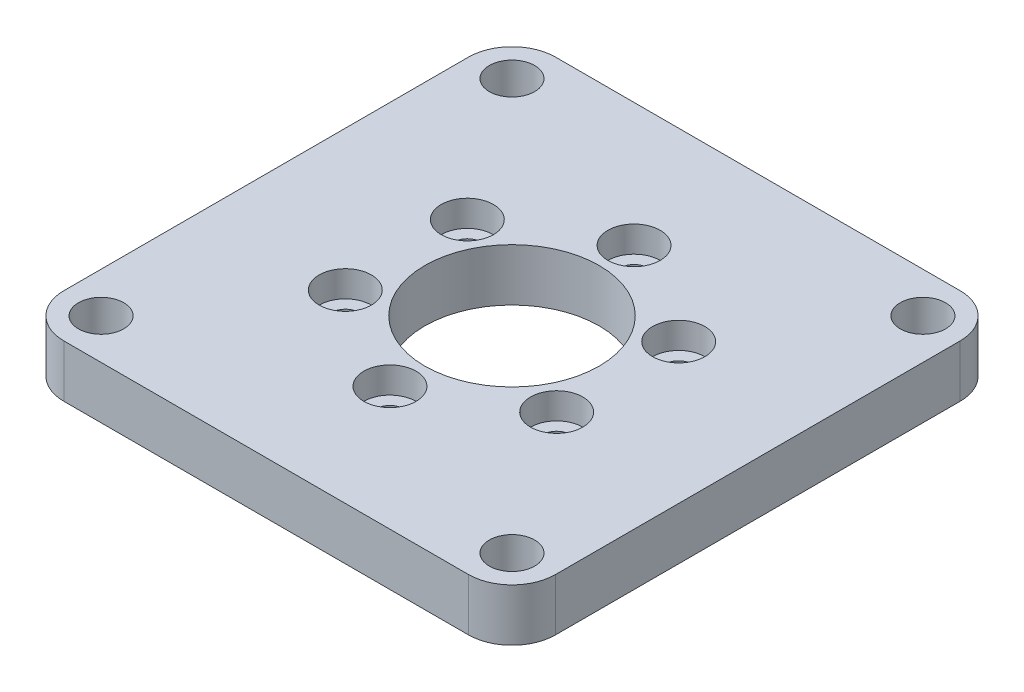
ISO-10303-21;
HEADER;
FILE_DESCRIPTION(('STEP AP214'),'2;1');
FILE_NAME('part.step','',(''),(''),'','','');
FILE_SCHEMA(('AUTOMOTIVE_DESIGN { 1 0 10303 214 1 1 1 1 }'));
ENDSEC;
DATA;
#1=APPLICATION_CONTEXT('core data for automotive mechanical design processes');
#2=APPLICATION_PROTOCOL_DEFINITION('international standard','automotive_design',2000,#1);
#3=PRODUCT_CONTEXT('',#1,'mechanical');
#4=PRODUCT('Part','Part','',(#3));
#5=PRODUCT_RELATED_PRODUCT_CATEGORY('part','',(#4));
#6=PRODUCT_DEFINITION_FORMATION('','',#4);
#7=PRODUCT_DEFINITION_CONTEXT('part definition',#1,'design');
#8=PRODUCT_DEFINITION('design','',#6,#7);
#9=PRODUCT_DEFINITION_SHAPE('','',#8);
#10=(LENGTH_UNIT() NAMED_UNIT(*) SI_UNIT(.MILLI.,.METRE.));
#11=(NAMED_UNIT(*) PLANE_ANGLE_UNIT() SI_UNIT($,.RADIAN.));
#12=(NAMED_UNIT(*) SI_UNIT($,.STERADIAN.) SOLID_ANGLE_UNIT());
#13=UNCERTAINTY_MEASURE_WITH_UNIT(LENGTH_MEASURE(1.E-05),#10,'distance_accuracy_value','');
#14=(GEOMETRIC_REPRESENTATION_CONTEXT(3) GLOBAL_UNCERTAINTY_ASSIGNED_CONTEXT((#13)) GLOBAL_UNIT_ASSIGNED_CONTEXT((#10,
#11,#12)) REPRESENTATION_CONTEXT('',''));
#15=CARTESIAN_POINT('',(0.,0.,0.));
#16=DIRECTION('',(0.,0.,1.));
#17=DIRECTION('',(1.,0.,0.));
#18=AXIS2_PLACEMENT_3D('',#15,#16,#17);
#19=CARTESIAN_POINT('',(-12.1243556529821,-3.,-7.00000000000014));
#20=DIRECTION('',(0.,1.,0.));
#21=DIRECTION('',(0.,0.,1.));
#22=AXIS2_PLACEMENT_3D('',#19,#20,#21);
#23=CYLINDRICAL_SURFACE('',#22,1.55);
#24=CARTESIAN_POINT('',(-12.1243556529821,-3.,-7.00000000000014));
#25=DIRECTION('',(0.,1.,0.));
#26=DIRECTION('',(0.866025403784433,0.,0.50000000000001));
#27=AXIS2_PLACEMENT_3D('',#24,#25,#26);
#28=CIRCLE('',#27,1.55);
#29=CARTESIAN_POINT('',(-10.7820162771162,-3.,-6.22500000000013));
#30=VERTEX_POINT('',#29);
#31=EDGE_CURVE('E169',#30,#30,#28,.T.);
#32=ORIENTED_EDGE('',*,*,#31,.F.);
#33=EDGE_LOOP('',(#32));
#34=FACE_BOUND('',#33,.T.);
#35=CARTESIAN_POINT('',(-12.1243556529821,0.,-7.00000000000014));
#36=DIRECTION('',(0.,1.,0.));
#37=DIRECTION('',(0.,0.,1.));
#38=AXIS2_PLACEMENT_3D('',#35,#36,#37);
#39=CIRCLE('',#38,1.55);
#40=CARTESIAN_POINT('',(-12.1243556529821,0.,-5.45000000000014));
#41=VERTEX_POINT('',#40);
#42=EDGE_CURVE('E41',#41,#41,#39,.F.);
#43=ORIENTED_EDGE('',*,*,#42,.F.);
#44=EDGE_LOOP('',(#43));
#45=FACE_BOUND('',#44,.T.);
#46=ADVANCED_FACE('F37',(#34,#45),#23,.F.);
#47=CARTESIAN_POINT('',(-12.1243556529822,-3.,6.99999999999989));
#48=DIRECTION('',(0.,1.,0.));
#49=DIRECTION('',(0.,0.,1.));
#50=AXIS2_PLACEMENT_3D('',#47,#48,#49);
#51=CYLINDRICAL_SURFACE('',#50,1.55);
#52=CARTESIAN_POINT('',(-12.1243556529822,-3.,6.99999999999989));
#53=DIRECTION('',(0.,1.,0.));
#54=DIRECTION('',(0.866025403784443,0.,-0.499999999999992));
#55=AXIS2_PLACEMENT_3D('',#52,#53,#54);
#56=CIRCLE('',#55,1.55);
#57=CARTESIAN_POINT('',(-10.7820162771163,-3.,6.2249999999999));
#58=VERTEX_POINT('',#57);
#59=EDGE_CURVE('E211',#58,#58,#56,.T.);
#60=ORIENTED_EDGE('',*,*,#59,.F.);
#61=EDGE_LOOP('',(#60));
#62=FACE_BOUND('',#61,.T.);
#63=CARTESIAN_POINT('',(-12.1243556529822,0.,6.99999999999989));
#64=DIRECTION('',(0.,1.,0.));
#65=DIRECTION('',(0.,0.,1.));
#66=AXIS2_PLACEMENT_3D('',#63,#64,#65);
#67=CIRCLE('',#66,1.55);
#68=CARTESIAN_POINT('',(-12.1243556529822,0.,8.54999999999989));
#69=VERTEX_POINT('',#68);
#70=EDGE_CURVE('E180',#69,#69,#67,.F.);
#71=ORIENTED_EDGE('',*,*,#70,.F.);
#72=EDGE_LOOP('',(#71));
#73=FACE_BOUND('',#72,.T.);
#74=ADVANCED_FACE('F288',(#62,#73),#51,.F.);
#75=CARTESIAN_POINT('',(0.,-3.,14.));
#76=DIRECTION('',(0.,1.,0.));
#77=DIRECTION('',(0.,0.,1.));
#78=AXIS2_PLACEMENT_3D('',#75,#76,#77);
#79=CYLINDRICAL_SURFACE('',#78,1.55);
#80=CARTESIAN_POINT('',(0.,-3.,14.));
#81=DIRECTION('',(0.,1.,0.));
#82=DIRECTION('',(0.,0.,-1.));
#83=AXIS2_PLACEMENT_3D('',#80,#81,#82);
#84=CIRCLE('',#83,1.55);
#85=CARTESIAN_POINT('',(0.,-3.,12.45));
#86=VERTEX_POINT('',#85);
#87=EDGE_CURVE('E214',#86,#86,#84,.T.);
#88=ORIENTED_EDGE('',*,*,#87,.F.);
#89=EDGE_LOOP('',(#88));
#90=FACE_BOUND('',#89,.T.);
#91=CARTESIAN_POINT('',(0.,0.,14.));
#92=DIRECTION('',(0.,1.,0.));
#93=DIRECTION('',(0.,0.,1.));
#94=AXIS2_PLACEMENT_3D('',#91,#92,#93);
#95=CIRCLE('',#94,1.55);
#96=CARTESIAN_POINT('',(0.,0.,15.55));
#97=VERTEX_POINT('',#96);
#98=EDGE_CURVE('E176',#97,#97,#95,.F.);
#99=ORIENTED_EDGE('',*,*,#98,.F.);
#100=EDGE_LOOP('',(#99));
#101=FACE_BOUND('',#100,.T.);
#102=ADVANCED_FACE('F294',(#90,#101),#79,.F.);
#103=CARTESIAN_POINT('',(12.1243556529821,-3.,7.00000000000006));
#104=DIRECTION('',(0.,1.,0.));
#105=DIRECTION('',(0.,0.,1.));
#106=AXIS2_PLACEMENT_3D('',#103,#104,#105);
#107=CYLINDRICAL_SURFACE('',#106,1.55);
#108=CARTESIAN_POINT('',(12.1243556529821,-3.,7.00000000000006));
#109=DIRECTION('',(0.,1.,0.));
#110=DIRECTION('',(-0.866025403784436,0.,-0.500000000000004));
#111=AXIS2_PLACEMENT_3D('',#108,#109,#110);
#112=CIRCLE('',#111,1.55);
#113=CARTESIAN_POINT('',(10.7820162771162,-3.,6.22500000000005));
#114=VERTEX_POINT('',#113);
#115=EDGE_CURVE('E217',#114,#114,#112,.T.);
#116=ORIENTED_EDGE('',*,*,#115,.F.);
#117=EDGE_LOOP('',(#116));
#118=FACE_BOUND('',#117,.T.);
#119=CARTESIAN_POINT('',(12.1243556529821,0.,7.00000000000006));
#120=DIRECTION('',(0.,1.,0.));
#121=DIRECTION('',(0.,0.,1.));
#122=AXIS2_PLACEMENT_3D('',#119,#120,#121);
#123=CIRCLE('',#122,1.55);
#124=CARTESIAN_POINT('',(12.1243556529821,0.,8.55000000000006));
#125=VERTEX_POINT('',#124);
#126=EDGE_CURVE('E171',#125,#125,#123,.F.);
#127=ORIENTED_EDGE('',*,*,#126,.F.);
#128=EDGE_LOOP('',(#127));
#129=FACE_BOUND('',#128,.T.);
#130=ADVANCED_FACE('F305',(#118,#129),#107,.F.);
#131=CARTESIAN_POINT('',(12.1243556529822,-3.,-6.99999999999997));
#132=DIRECTION('',(0.,1.,0.));
#133=DIRECTION('',(0.,0.,1.));
#134=AXIS2_PLACEMENT_3D('',#131,#132,#133);
#135=CYLINDRICAL_SURFACE('',#134,1.55);
#136=CARTESIAN_POINT('',(12.1243556529822,-3.,-6.99999999999997));
#137=DIRECTION('',(0.,1.,0.));
#138=DIRECTION('',(-0.86602540378444,0.,0.499999999999998));
#139=AXIS2_PLACEMENT_3D('',#136,#137,#138);
#140=CIRCLE('',#139,1.55);
#141=CARTESIAN_POINT('',(10.7820162771163,-3.,-6.22499999999998));
#142=VERTEX_POINT('',#141);
#143=EDGE_CURVE('E220',#142,#142,#140,.T.);
#144=ORIENTED_EDGE('',*,*,#143,.F.);
#145=EDGE_LOOP('',(#144));
#146=FACE_BOUND('',#145,.T.);
#147=CARTESIAN_POINT('',(12.1243556529822,0.,-6.99999999999997));
#148=DIRECTION('',(0.,1.,0.));
#149=DIRECTION('',(0.,0.,1.));
#150=AXIS2_PLACEMENT_3D('',#147,#148,#149);
#151=CIRCLE('',#150,1.55);
#152=CARTESIAN_POINT('',(12.1243556529822,0.,-5.44999999999997));
#153=VERTEX_POINT('',#152);
#154=EDGE_CURVE('E166',#153,#153,#151,.F.);
#155=ORIENTED_EDGE('',*,*,#154,.F.);
#156=EDGE_LOOP('',(#155));
#157=FACE_BOUND('',#156,.T.);
#158=ADVANCED_FACE('F309',(#146,#157),#135,.F.);
#159=CARTESIAN_POINT('',(0.,-3.,-14.));
#160=DIRECTION('',(0.,1.,0.));
#161=DIRECTION('',(0.,0.,1.));
#162=AXIS2_PLACEMENT_3D('',#159,#160,#161);
#163=CYLINDRICAL_SURFACE('',#162,1.55);
#164=CARTESIAN_POINT('',(0.,-3.,-14.));
#165=DIRECTION('',(0.,1.,0.));
#166=DIRECTION('',(0.,0.,1.));
#167=AXIS2_PLACEMENT_3D('',#164,#165,#166);
#168=CIRCLE('',#167,1.55);
#169=CARTESIAN_POINT('',(0.,-3.,-12.45));
#170=VERTEX_POINT('',#169);
#171=EDGE_CURVE('E164',#170,#170,#168,.T.);
#172=ORIENTED_EDGE('',*,*,#171,.F.);
#173=EDGE_LOOP('',(#172));
#174=FACE_BOUND('',#173,.T.);
#175=CARTESIAN_POINT('',(0.,0.,-14.));
#176=DIRECTION('',(0.,1.,0.));
#177=DIRECTION('',(0.,0.,1.));
#178=AXIS2_PLACEMENT_3D('',#175,#176,#177);
#179=CIRCLE('',#178,1.55);
#180=CARTESIAN_POINT('',(0.,0.,-12.45));
#181=VERTEX_POINT('',#180);
#182=EDGE_CURVE('E161',#181,#181,#179,.F.);
#183=ORIENTED_EDGE('',*,*,#182,.F.);
#184=EDGE_LOOP('',(#183));
#185=FACE_BOUND('',#184,.T.);
#186=ADVANCED_FACE('F313',(#174,#185),#163,.F.);
#187=CARTESIAN_POINT('',(28.2,3.,-28.2));
#188=DIRECTION('',(-1.,0.,0.));
#189=DIRECTION('',(0.,0.,1.));
#190=AXIS2_PLACEMENT_3D('',#187,#188,#189);
#191=PLANE('',#190);
#192=DIRECTION('',(0.,0.,-1.));
#193=VECTOR('',#192,1.);
#194=CARTESIAN_POINT('',(28.2,-3.,-28.2));
#195=LINE('',#194,#193);
#196=CARTESIAN_POINT('',(28.2,-3.,23.2));
#197=VERTEX_POINT('',#196);
#198=CARTESIAN_POINT('',(28.2,-3.,-23.2));
#199=VERTEX_POINT('',#198);
#200=EDGE_CURVE('E258',#197,#199,#195,.T.);
#201=ORIENTED_EDGE('',*,*,#200,.T.);
#202=DIRECTION('',(0.,-1.,0.));
#203=VECTOR('',#202,1.);
#204=CARTESIAN_POINT('',(28.2,3.,-23.2));
#205=LINE('',#204,#203);
#206=CARTESIAN_POINT('',(28.2,3.,-23.2));
#207=VERTEX_POINT('',#206);
#208=EDGE_CURVE('E11',#199,#207,#205,.F.);
#209=ORIENTED_EDGE('',*,*,#208,.T.);
#210=DIRECTION('',(0.,0.,-1.));
#211=VECTOR('',#210,1.);
#212=CARTESIAN_POINT('',(28.2,3.,-28.2));
#213=LINE('',#212,#211);
#214=CARTESIAN_POINT('',(28.2,3.,23.2));
#215=VERTEX_POINT('',#214);
#216=EDGE_CURVE('E131',#215,#207,#213,.T.);
#217=ORIENTED_EDGE('',*,*,#216,.F.);
#218=DIRECTION('',(0.,-1.,0.));
#219=VECTOR('',#218,1.);
#220=CARTESIAN_POINT('',(28.2,3.,23.2));
#221=LINE('',#220,#219);
#222=EDGE_CURVE('E46',#215,#197,#221,.T.);
#223=ORIENTED_EDGE('',*,*,#222,.T.);
#224=EDGE_LOOP('',(#201,#209,#217,#223));
#225=FACE_BOUND('',#224,.T.);
#226=ADVANCED_FACE('F285',(#225),#191,.F.);
#227=CARTESIAN_POINT('',(-28.2,3.,-28.2));
#228=DIRECTION('',(0.,0.,1.));
#229=DIRECTION('',(1.,0.,0.));
#230=AXIS2_PLACEMENT_3D('',#227,#228,#229);
#231=PLANE('',#230);
#232=DIRECTION('',(-1.,0.,0.));
#233=VECTOR('',#232,1.);
#234=CARTESIAN_POINT('',(-28.2,-3.,-28.2));
#235=LINE('',#234,#233);
#236=CARTESIAN_POINT('',(23.2,-3.,-28.2));
#237=VERTEX_POINT('',#236);
#238=CARTESIAN_POINT('',(-23.2,-3.,-28.2));
#239=VERTEX_POINT('',#238);
#240=EDGE_CURVE('E136',#237,#239,#235,.T.);
#241=ORIENTED_EDGE('',*,*,#240,.T.);
#242=DIRECTION('',(0.,-1.,0.));
#243=VECTOR('',#242,1.);
#244=CARTESIAN_POINT('',(-23.2,3.,-28.2));
#245=LINE('',#244,#243);
#246=CARTESIAN_POINT('',(-23.2,3.,-28.2));
#247=VERTEX_POINT('',#246);
#248=EDGE_CURVE('E54',#239,#247,#245,.F.);
#249=ORIENTED_EDGE('',*,*,#248,.T.);
#250=DIRECTION('',(-1.,0.,0.));
#251=VECTOR('',#250,1.);
#252=CARTESIAN_POINT('',(-28.2,3.,-28.2));
#253=LINE('',#252,#251);
#254=CARTESIAN_POINT('',(23.2,3.,-28.2));
#255=VERTEX_POINT('',#254);
#256=EDGE_CURVE('E134',#255,#247,#253,.T.);
#257=ORIENTED_EDGE('',*,*,#256,.F.);
#258=DIRECTION('',(0.,-1.,0.));
#259=VECTOR('',#258,1.);
#260=CARTESIAN_POINT('',(23.2,3.,-28.2));
#261=LINE('',#260,#259);
#262=EDGE_CURVE('E155',#255,#237,#261,.T.);
#263=ORIENTED_EDGE('',*,*,#262,.T.);
#264=EDGE_LOOP('',(#241,#249,#257,#263));
#265=FACE_BOUND('',#264,.T.);
#266=ADVANCED_FACE('F268',(#265),#231,.F.);
#267=CARTESIAN_POINT('',(-28.2,3.,-28.2));
#268=DIRECTION('',(1.,0.,0.));
#269=DIRECTION('',(0.,0.,-1.));
#270=AXIS2_PLACEMENT_3D('',#267,#268,#269);
#271=PLANE('',#270);
#272=DIRECTION('',(0.,0.,1.));
#273=VECTOR('',#272,1.);
#274=CARTESIAN_POINT('',(-28.2,-3.,-28.2));
#275=LINE('',#274,#273);
#276=CARTESIAN_POINT('',(-28.2,-3.,-23.2));
#277=VERTEX_POINT('',#276);
#278=CARTESIAN_POINT('',(-28.2,-3.,23.2));
#279=VERTEX_POINT('',#278);
#280=EDGE_CURVE('E132',#277,#279,#275,.T.);
#281=ORIENTED_EDGE('',*,*,#280,.T.);
#282=DIRECTION('',(0.,-1.,0.));
#283=VECTOR('',#282,1.);
#284=CARTESIAN_POINT('',(-28.2,3.,23.2));
#285=LINE('',#284,#283);
#286=CARTESIAN_POINT('',(-28.2,3.,23.2));
#287=VERTEX_POINT('',#286);
#288=EDGE_CURVE('E110',#279,#287,#285,.F.);
#289=ORIENTED_EDGE('',*,*,#288,.T.);
#290=DIRECTION('',(0.,0.,1.));
#291=VECTOR('',#290,1.);
#292=CARTESIAN_POINT('',(-28.2,3.,-28.2));
#293=LINE('',#292,#291);
#294=CARTESIAN_POINT('',(-28.2,3.,-23.2));
#295=VERTEX_POINT('',#294);
#296=EDGE_CURVE('E262',#295,#287,#293,.T.);
#297=ORIENTED_EDGE('',*,*,#296,.F.);
#298=DIRECTION('',(0.,-1.,0.));
#299=VECTOR('',#298,1.);
#300=CARTESIAN_POINT('',(-28.2,3.,-23.2));
#301=LINE('',#300,#299);
#302=EDGE_CURVE('E115',#295,#277,#301,.T.);
#303=ORIENTED_EDGE('',*,*,#302,.T.);
#304=EDGE_LOOP('',(#281,#289,#297,#303));
#305=FACE_BOUND('',#304,.T.);
#306=ADVANCED_FACE('F277',(#305),#271,.F.);
#307=CARTESIAN_POINT('',(-28.2,3.,28.2));
#308=DIRECTION('',(0.,0.,-1.));
#309=DIRECTION('',(-1.,0.,0.));
#310=AXIS2_PLACEMENT_3D('',#307,#308,#309);
#311=PLANE('',#310);
#312=DIRECTION('',(1.,0.,0.));
#313=VECTOR('',#312,1.);
#314=CARTESIAN_POINT('',(-28.2,3.,28.2));
#315=LINE('',#314,#313);
#316=CARTESIAN_POINT('',(-23.2,3.,28.2));
#317=VERTEX_POINT('',#316);
#318=CARTESIAN_POINT('',(23.2,3.,28.2));
#319=VERTEX_POINT('',#318);
#320=EDGE_CURVE('E125',#317,#319,#315,.T.);
#321=ORIENTED_EDGE('',*,*,#320,.F.);
#322=DIRECTION('',(0.,-1.,0.));
#323=VECTOR('',#322,1.);
#324=CARTESIAN_POINT('',(-23.2,3.,28.2));
#325=LINE('',#324,#323);
#326=CARTESIAN_POINT('',(-23.2,-3.,28.2));
#327=VERTEX_POINT('',#326);
#328=EDGE_CURVE('E109',#317,#327,#325,.T.);
#329=ORIENTED_EDGE('',*,*,#328,.T.);
#330=DIRECTION('',(1.,0.,0.));
#331=VECTOR('',#330,1.);
#332=CARTESIAN_POINT('',(-28.2,-3.,28.2));
#333=LINE('',#332,#331);
#334=CARTESIAN_POINT('',(23.2,-3.,28.2));
#335=VERTEX_POINT('',#334);
#336=EDGE_CURVE('E122',#327,#335,#333,.T.);
#337=ORIENTED_EDGE('',*,*,#336,.T.);
#338=DIRECTION('',(0.,-1.,0.));
#339=VECTOR('',#338,1.);
#340=CARTESIAN_POINT('',(23.2,3.,28.2));
#341=LINE('',#340,#339);
#342=EDGE_CURVE('E127',#335,#319,#341,.F.);
#343=ORIENTED_EDGE('',*,*,#342,.T.);
#344=EDGE_LOOP('',(#321,#329,#337,#343));
#345=FACE_BOUND('',#344,.T.);
#346=ADVANCED_FACE('F121',(#345),#311,.F.);
#347=CARTESIAN_POINT('',(0.,3.,0.));
#348=DIRECTION('',(0.,1.,0.));
#349=DIRECTION('',(0.,0.,1.));
#350=AXIS2_PLACEMENT_3D('',#347,#348,#349);
#351=PLANE('',#350);
#352=CARTESIAN_POINT('',(-12.1243556529821,3.,-7.00000000000014));
#353=DIRECTION('',(0.,1.,0.));
#354=DIRECTION('',(0.866025403784433,0.,0.50000000000001));
#355=AXIS2_PLACEMENT_3D('',#352,#353,#354);
#356=CIRCLE('',#355,3.);
#357=CARTESIAN_POINT('',(-9.52627944162876,3.,-5.50000000000011));
#358=VERTEX_POINT('',#357);
#359=EDGE_CURVE('E196',#358,#358,#356,.T.);
#360=ORIENTED_EDGE('',*,*,#359,.F.);
#361=EDGE_LOOP('',(#360));
#362=FACE_BOUND('',#361,.T.);
#363=CARTESIAN_POINT('',(-12.1243556529822,3.,6.99999999999989));
#364=DIRECTION('',(0.,1.,0.));
#365=DIRECTION('',(0.866025403784443,0.,-0.499999999999992));
#366=AXIS2_PLACEMENT_3D('',#363,#364,#365);
#367=CIRCLE('',#366,3.);
#368=CARTESIAN_POINT('',(-9.52627944162888,3.,5.49999999999991));
#369=VERTEX_POINT('',#368);
#370=EDGE_CURVE('E189',#369,#369,#367,.T.);
#371=ORIENTED_EDGE('',*,*,#370,.F.);
#372=EDGE_LOOP('',(#371));
#373=FACE_BOUND('',#372,.T.);
#374=CARTESIAN_POINT('',(0.,3.,14.));
#375=DIRECTION('',(0.,1.,0.));
#376=DIRECTION('',(0.,0.,-1.));
#377=AXIS2_PLACEMENT_3D('',#374,#375,#376);
#378=CIRCLE('',#377,3.);
#379=CARTESIAN_POINT('',(0.,3.,11.));
#380=VERTEX_POINT('',#379);
#381=EDGE_CURVE('E182',#380,#380,#378,.T.);
#382=ORIENTED_EDGE('',*,*,#381,.F.);
#383=EDGE_LOOP('',(#382));
#384=FACE_BOUND('',#383,.T.);
#385=CARTESIAN_POINT('',(12.1243556529821,3.,7.00000000000006));
#386=DIRECTION('',(0.,1.,0.));
#387=DIRECTION('',(-0.866025403784436,0.,-0.500000000000004));
#388=AXIS2_PLACEMENT_3D('',#385,#386,#387);
#389=CIRCLE('',#388,3.);
#390=CARTESIAN_POINT('',(9.5262794416288,3.,5.50000000000004));
#391=VERTEX_POINT('',#390);
#392=EDGE_CURVE('E178',#391,#391,#389,.T.);
#393=ORIENTED_EDGE('',*,*,#392,.F.);
#394=EDGE_LOOP('',(#393));
#395=FACE_BOUND('',#394,.T.);
#396=CARTESIAN_POINT('',(12.1243556529822,3.,-6.99999999999997));
#397=DIRECTION('',(0.,1.,0.));
#398=DIRECTION('',(-0.86602540378444,0.,0.499999999999998));
#399=AXIS2_PLACEMENT_3D('',#396,#397,#398);
#400=CIRCLE('',#399,3.);
#401=CARTESIAN_POINT('',(9.52627944162884,3.,-5.49999999999998));
#402=VERTEX_POINT('',#401);
#403=EDGE_CURVE('E174',#402,#402,#400,.T.);
#404=ORIENTED_EDGE('',*,*,#403,.F.);
#405=EDGE_LOOP('',(#404));
#406=FACE_BOUND('',#405,.T.);
#407=CARTESIAN_POINT('',(0.,3.,-14.));
#408=DIRECTION('',(0.,1.,0.));
#409=DIRECTION('',(0.,0.,1.));
#410=AXIS2_PLACEMENT_3D('',#407,#408,#409);
#411=CIRCLE('',#410,3.);
#412=CARTESIAN_POINT('',(0.,3.,-11.));
#413=VERTEX_POINT('',#412);
#414=EDGE_CURVE('E223',#413,#413,#411,.T.);
#415=ORIENTED_EDGE('',*,*,#414,.F.);
#416=EDGE_LOOP('',(#415));
#417=FACE_BOUND('',#416,.T.);
#418=CARTESIAN_POINT('',(0.,3.,0.));
#419=DIRECTION('',(0.,-1.,0.));
#420=DIRECTION('',(0.,0.,-1.));
#421=AXIS2_PLACEMENT_3D('',#418,#419,#420);
#422=CIRCLE('',#421,10.);
#423=CARTESIAN_POINT('',(0.,3.,-10.));
#424=VERTEX_POINT('',#423);
#425=EDGE_CURVE('E231',#424,#424,#422,.T.);
#426=ORIENTED_EDGE('',*,*,#425,.T.);
#427=EDGE_LOOP('',(#426));
#428=FACE_BOUND('',#427,.T.);
#429=CARTESIAN_POINT('',(-23.57,3.,-23.57));
#430=DIRECTION('',(0.,-1.,0.));
#431=DIRECTION('',(0.,0.,-1.));
#432=AXIS2_PLACEMENT_3D('',#429,#430,#431);
#433=CIRCLE('',#432,2.6);
#434=CARTESIAN_POINT('',(-23.57,3.,-26.17));
#435=VERTEX_POINT('',#434);
#436=EDGE_CURVE('E237',#435,#435,#433,.T.);
#437=ORIENTED_EDGE('',*,*,#436,.T.);
#438=EDGE_LOOP('',(#437));
#439=FACE_BOUND('',#438,.T.);
#440=CARTESIAN_POINT('',(23.57,3.,-23.57));
#441=DIRECTION('',(0.,-1.,0.));
#442=DIRECTION('',(0.,0.,-1.));
#443=AXIS2_PLACEMENT_3D('',#440,#441,#442);
#444=CIRCLE('',#443,2.6);
#445=CARTESIAN_POINT('',(23.57,3.,-26.17));
#446=VERTEX_POINT('',#445);
#447=EDGE_CURVE('E243',#446,#446,#444,.T.);
#448=ORIENTED_EDGE('',*,*,#447,.T.);
#449=EDGE_LOOP('',(#448));
#450=FACE_BOUND('',#449,.T.);
#451=CARTESIAN_POINT('',(23.57,3.,23.57));
#452=DIRECTION('',(0.,-1.,0.));
#453=DIRECTION('',(0.,0.,-1.));
#454=AXIS2_PLACEMENT_3D('',#451,#452,#453);
#455=CIRCLE('',#454,2.6);
#456=CARTESIAN_POINT('',(23.57,3.,20.97));
#457=VERTEX_POINT('',#456);
#458=EDGE_CURVE('E249',#457,#457,#455,.T.);
#459=ORIENTED_EDGE('',*,*,#458,.T.);
#460=EDGE_LOOP('',(#459));
#461=FACE_BOUND('',#460,.T.);
#462=CARTESIAN_POINT('',(-23.57,3.,23.57));
#463=DIRECTION('',(0.,-1.,0.));
#464=DIRECTION('',(0.,0.,-1.));
#465=AXIS2_PLACEMENT_3D('',#462,#463,#464);
#466=CIRCLE('',#465,2.6);
#467=CARTESIAN_POINT('',(-23.57,3.,20.97));
#468=VERTEX_POINT('',#467);
#469=EDGE_CURVE('E255',#468,#468,#466,.T.);
#470=ORIENTED_EDGE('',*,*,#469,.T.);
#471=EDGE_LOOP('',(#470));
#472=FACE_BOUND('',#471,.T.);
#473=ORIENTED_EDGE('',*,*,#296,.T.);
#474=CARTESIAN_POINT('',(-23.2,3.,23.2));
#475=DIRECTION('',(0.,1.,0.));
#476=DIRECTION('',(0.,0.,1.));
#477=AXIS2_PLACEMENT_3D('',#474,#475,#476);
#478=CIRCLE('',#477,5.);
#479=EDGE_CURVE('E153',#287,#317,#478,.T.);
#480=ORIENTED_EDGE('',*,*,#479,.T.);
#481=ORIENTED_EDGE('',*,*,#320,.T.);
#482=CARTESIAN_POINT('',(23.2,3.,23.2));
#483=DIRECTION('',(0.,1.,0.));
#484=DIRECTION('',(0.,0.,1.));
#485=AXIS2_PLACEMENT_3D('',#482,#483,#484);
#486=CIRCLE('',#485,5.);
#487=EDGE_CURVE('E148',#319,#215,#486,.T.);
#488=ORIENTED_EDGE('',*,*,#487,.T.);
#489=ORIENTED_EDGE('',*,*,#216,.T.);
#490=CARTESIAN_POINT('',(23.2,3.,-23.2));
#491=DIRECTION('',(0.,1.,0.));
#492=DIRECTION('',(0.,0.,1.));
#493=AXIS2_PLACEMENT_3D('',#490,#491,#492);
#494=CIRCLE('',#493,5.);
#495=EDGE_CURVE('E61',#207,#255,#494,.T.);
#496=ORIENTED_EDGE('',*,*,#495,.T.);
#497=ORIENTED_EDGE('',*,*,#256,.T.);
#498=CARTESIAN_POINT('',(-23.2,3.,-23.2));
#499=DIRECTION('',(0.,1.,0.));
#500=DIRECTION('',(0.,0.,1.));
#501=AXIS2_PLACEMENT_3D('',#498,#499,#500);
#502=CIRCLE('',#501,5.);
#503=EDGE_CURVE('E151',#247,#295,#502,.T.);
#504=ORIENTED_EDGE('',*,*,#503,.T.);
#505=EDGE_LOOP('',(#473,#480,#481,#488,#489,#496,#497,#504));
#506=FACE_BOUND('',#505,.T.);
#507=ADVANCED_FACE('F275',(#362,#373,#384,#395,#406,#417,#428,#439,#450,#461,#472,#506),#351,.T.);
#508=CARTESIAN_POINT('',(0.,-3.,0.));
#509=DIRECTION('',(0.,1.,0.));
#510=DIRECTION('',(0.,0.,1.));
#511=AXIS2_PLACEMENT_3D('',#508,#509,#510);
#512=PLANE('',#511);
#513=ORIENTED_EDGE('',*,*,#31,.T.);
#514=EDGE_LOOP('',(#513));
#515=FACE_BOUND('',#514,.T.);
#516=ORIENTED_EDGE('',*,*,#59,.T.);
#517=EDGE_LOOP('',(#516));
#518=FACE_BOUND('',#517,.T.);
#519=ORIENTED_EDGE('',*,*,#87,.T.);
#520=EDGE_LOOP('',(#519));
#521=FACE_BOUND('',#520,.T.);
#522=ORIENTED_EDGE('',*,*,#115,.T.);
#523=EDGE_LOOP('',(#522));
#524=FACE_BOUND('',#523,.T.);
#525=ORIENTED_EDGE('',*,*,#143,.T.);
#526=EDGE_LOOP('',(#525));
#527=FACE_BOUND('',#526,.T.);
#528=ORIENTED_EDGE('',*,*,#171,.T.);
#529=EDGE_LOOP('',(#528));
#530=FACE_BOUND('',#529,.T.);
#531=CARTESIAN_POINT('',(0.,-3.,0.));
#532=DIRECTION('',(0.,-1.,0.));
#533=DIRECTION('',(0.,0.,-1.));
#534=AXIS2_PLACEMENT_3D('',#531,#532,#533);
#535=CIRCLE('',#534,10.);
#536=CARTESIAN_POINT('',(0.,-3.,-10.));
#537=VERTEX_POINT('',#536);
#538=EDGE_CURVE('E230',#537,#537,#535,.T.);
#539=ORIENTED_EDGE('',*,*,#538,.F.);
#540=EDGE_LOOP('',(#539));
#541=FACE_BOUND('',#540,.T.);
#542=CARTESIAN_POINT('',(-23.57,-3.,-23.57));
#543=DIRECTION('',(0.,-1.,0.));
#544=DIRECTION('',(0.,0.,-1.));
#545=AXIS2_PLACEMENT_3D('',#542,#543,#544);
#546=CIRCLE('',#545,2.6);
#547=CARTESIAN_POINT('',(-23.57,-3.,-26.17));
#548=VERTEX_POINT('',#547);
#549=EDGE_CURVE('E234',#548,#548,#546,.T.);
#550=ORIENTED_EDGE('',*,*,#549,.F.);
#551=EDGE_LOOP('',(#550));
#552=FACE_BOUND('',#551,.T.);
#553=CARTESIAN_POINT('',(23.57,-3.,-23.57));
#554=DIRECTION('',(0.,-1.,0.));
#555=DIRECTION('',(0.,0.,-1.));
#556=AXIS2_PLACEMENT_3D('',#553,#554,#555);
#557=CIRCLE('',#556,2.6);
#558=CARTESIAN_POINT('',(23.57,-3.,-26.17));
#559=VERTEX_POINT('',#558);
#560=EDGE_CURVE('E240',#559,#559,#557,.T.);
#561=ORIENTED_EDGE('',*,*,#560,.F.);
#562=EDGE_LOOP('',(#561));
#563=FACE_BOUND('',#562,.T.);
#564=CARTESIAN_POINT('',(23.57,-3.,23.57));
#565=DIRECTION('',(0.,-1.,0.));
#566=DIRECTION('',(0.,0.,-1.));
#567=AXIS2_PLACEMENT_3D('',#564,#565,#566);
#568=CIRCLE('',#567,2.6);
#569=CARTESIAN_POINT('',(23.57,-3.,20.97));
#570=VERTEX_POINT('',#569);
#571=EDGE_CURVE('E246',#570,#570,#568,.T.);
#572=ORIENTED_EDGE('',*,*,#571,.F.);
#573=EDGE_LOOP('',(#572));
#574=FACE_BOUND('',#573,.T.);
#575=CARTESIAN_POINT('',(-23.57,-3.,23.57));
#576=DIRECTION('',(0.,-1.,0.));
#577=DIRECTION('',(0.,0.,-1.));
#578=AXIS2_PLACEMENT_3D('',#575,#576,#577);
#579=CIRCLE('',#578,2.6);
#580=CARTESIAN_POINT('',(-23.57,-3.,20.97));
#581=VERTEX_POINT('',#580);
#582=EDGE_CURVE('E252',#581,#581,#579,.T.);
#583=ORIENTED_EDGE('',*,*,#582,.F.);
#584=EDGE_LOOP('',(#583));
#585=FACE_BOUND('',#584,.T.);
#586=ORIENTED_EDGE('',*,*,#336,.F.);
#587=CARTESIAN_POINT('',(-23.2,-3.,23.2));
#588=DIRECTION('',(0.,1.,0.));
#589=DIRECTION('',(0.,0.,1.));
#590=AXIS2_PLACEMENT_3D('',#587,#588,#589);
#591=CIRCLE('',#590,5.);
#592=EDGE_CURVE('E105',#327,#279,#591,.F.);
#593=ORIENTED_EDGE('',*,*,#592,.T.);
#594=ORIENTED_EDGE('',*,*,#280,.F.);
#595=CARTESIAN_POINT('',(-23.2,-3.,-23.2));
#596=DIRECTION('',(0.,1.,0.));
#597=DIRECTION('',(0.,0.,1.));
#598=AXIS2_PLACEMENT_3D('',#595,#596,#597);
#599=CIRCLE('',#598,5.);
#600=EDGE_CURVE('E116',#277,#239,#599,.F.);
#601=ORIENTED_EDGE('',*,*,#600,.T.);
#602=ORIENTED_EDGE('',*,*,#240,.F.);
#603=CARTESIAN_POINT('',(23.2,-3.,-23.2));
#604=DIRECTION('',(0.,1.,0.));
#605=DIRECTION('',(0.,0.,1.));
#606=AXIS2_PLACEMENT_3D('',#603,#604,#605);
#607=CIRCLE('',#606,5.);
#608=EDGE_CURVE('E142',#237,#199,#607,.F.);
#609=ORIENTED_EDGE('',*,*,#608,.T.);
#610=ORIENTED_EDGE('',*,*,#200,.F.);
#611=CARTESIAN_POINT('',(23.2,-3.,23.2));
#612=DIRECTION('',(0.,1.,0.));
#613=DIRECTION('',(0.,0.,1.));
#614=AXIS2_PLACEMENT_3D('',#611,#612,#613);
#615=CIRCLE('',#614,5.);
#616=EDGE_CURVE('E126',#197,#335,#615,.F.);
#617=ORIENTED_EDGE('',*,*,#616,.T.);
#618=EDGE_LOOP('',(#586,#593,#594,#601,#602,#609,#610,#617));
#619=FACE_BOUND('',#618,.T.);
#620=ADVANCED_FACE('F129',(#515,#518,#521,#524,#527,#530,#541,#552,#563,#574,#585,#619),#512,.F.);
#621=CARTESIAN_POINT('',(-23.2,3.,23.2));
#622=DIRECTION('',(0.,-1.,0.));
#623=DIRECTION('',(0.,0.,-1.));
#624=AXIS2_PLACEMENT_3D('',#621,#622,#623);
#625=CYLINDRICAL_SURFACE('',#624,5.);
#626=ORIENTED_EDGE('',*,*,#479,.F.);
#627=ORIENTED_EDGE('',*,*,#288,.F.);
#628=ORIENTED_EDGE('',*,*,#592,.F.);
#629=ORIENTED_EDGE('',*,*,#328,.F.);
#630=EDGE_LOOP('',(#626,#627,#628,#629));
#631=FACE_BOUND('',#630,.T.);
#632=ADVANCED_FACE('F108',(#631),#625,.T.);
#633=CARTESIAN_POINT('',(-23.2,3.,-23.2));
#634=DIRECTION('',(0.,-1.,0.));
#635=DIRECTION('',(0.,0.,-1.));
#636=AXIS2_PLACEMENT_3D('',#633,#634,#635);
#637=CYLINDRICAL_SURFACE('',#636,5.);
#638=ORIENTED_EDGE('',*,*,#503,.F.);
#639=ORIENTED_EDGE('',*,*,#248,.F.);
#640=ORIENTED_EDGE('',*,*,#600,.F.);
#641=ORIENTED_EDGE('',*,*,#302,.F.);
#642=EDGE_LOOP('',(#638,#639,#640,#641));
#643=FACE_BOUND('',#642,.T.);
#644=ADVANCED_FACE('F272',(#643),#637,.T.);
#645=CARTESIAN_POINT('',(23.2,3.,-23.2));
#646=DIRECTION('',(0.,-1.,0.));
#647=DIRECTION('',(0.,0.,-1.));
#648=AXIS2_PLACEMENT_3D('',#645,#646,#647);
#649=CYLINDRICAL_SURFACE('',#648,5.);
#650=ORIENTED_EDGE('',*,*,#495,.F.);
#651=ORIENTED_EDGE('',*,*,#208,.F.);
#652=ORIENTED_EDGE('',*,*,#608,.F.);
#653=ORIENTED_EDGE('',*,*,#262,.F.);
#654=EDGE_LOOP('',(#650,#651,#652,#653));
#655=FACE_BOUND('',#654,.T.);
#656=ADVANCED_FACE('F581',(#655),#649,.T.);
#657=CARTESIAN_POINT('',(23.2,3.,23.2));
#658=DIRECTION('',(0.,-1.,0.));
#659=DIRECTION('',(0.,0.,-1.));
#660=AXIS2_PLACEMENT_3D('',#657,#658,#659);
#661=CYLINDRICAL_SURFACE('',#660,5.);
#662=ORIENTED_EDGE('',*,*,#487,.F.);
#663=ORIENTED_EDGE('',*,*,#342,.F.);
#664=ORIENTED_EDGE('',*,*,#616,.F.);
#665=ORIENTED_EDGE('',*,*,#222,.F.);
#666=EDGE_LOOP('',(#662,#663,#664,#665));
#667=FACE_BOUND('',#666,.T.);
#668=ADVANCED_FACE('F39',(#667),#661,.T.);
#669=CARTESIAN_POINT('',(-23.57,3.,23.57));
#670=DIRECTION('',(0.,-1.,0.));
#671=DIRECTION('',(0.,0.,-1.));
#672=AXIS2_PLACEMENT_3D('',#669,#670,#671);
#673=CYLINDRICAL_SURFACE('',#672,2.6);
#674=ORIENTED_EDGE('',*,*,#469,.F.);
#675=EDGE_LOOP('',(#674));
#676=FACE_BOUND('',#675,.T.);
#677=ORIENTED_EDGE('',*,*,#582,.T.);
#678=EDGE_LOOP('',(#677));
#679=FACE_BOUND('',#678,.T.);
#680=ADVANCED_FACE('F342',(#676,#679),#673,.F.);
#681=CARTESIAN_POINT('',(23.57,3.,23.57));
#682=DIRECTION('',(0.,-1.,0.));
#683=DIRECTION('',(0.,0.,-1.));
#684=AXIS2_PLACEMENT_3D('',#681,#682,#683);
#685=CYLINDRICAL_SURFACE('',#684,2.6);
#686=ORIENTED_EDGE('',*,*,#458,.F.);
#687=EDGE_LOOP('',(#686));
#688=FACE_BOUND('',#687,.T.);
#689=ORIENTED_EDGE('',*,*,#571,.T.);
#690=EDGE_LOOP('',(#689));
#691=FACE_BOUND('',#690,.T.);
#692=ADVANCED_FACE('F338',(#688,#691),#685,.F.);
#693=CARTESIAN_POINT('',(23.57,3.,-23.57));
#694=DIRECTION('',(0.,-1.,0.));
#695=DIRECTION('',(0.,0.,-1.));
#696=AXIS2_PLACEMENT_3D('',#693,#694,#695);
#697=CYLINDRICAL_SURFACE('',#696,2.6);
#698=ORIENTED_EDGE('',*,*,#447,.F.);
#699=EDGE_LOOP('',(#698));
#700=FACE_BOUND('',#699,.T.);
#701=ORIENTED_EDGE('',*,*,#560,.T.);
#702=EDGE_LOOP('',(#701));
#703=FACE_BOUND('',#702,.T.);
#704=ADVANCED_FACE('F334',(#700,#703),#697,.F.);
#705=CARTESIAN_POINT('',(-23.57,3.,-23.57));
#706=DIRECTION('',(0.,-1.,0.));
#707=DIRECTION('',(0.,0.,-1.));
#708=AXIS2_PLACEMENT_3D('',#705,#706,#707);
#709=CYLINDRICAL_SURFACE('',#708,2.6);
#710=ORIENTED_EDGE('',*,*,#436,.F.);
#711=EDGE_LOOP('',(#710));
#712=FACE_BOUND('',#711,.T.);
#713=ORIENTED_EDGE('',*,*,#549,.T.);
#714=EDGE_LOOP('',(#713));
#715=FACE_BOUND('',#714,.T.);
#716=ADVANCED_FACE('F330',(#712,#715),#709,.F.);
#717=CARTESIAN_POINT('',(0.,3.,0.));
#718=DIRECTION('',(0.,-1.,0.));
#719=DIRECTION('',(0.,0.,-1.));
#720=AXIS2_PLACEMENT_3D('',#717,#718,#719);
#721=CYLINDRICAL_SURFACE('',#720,10.);
#722=ORIENTED_EDGE('',*,*,#425,.F.);
#723=EDGE_LOOP('',(#722));
#724=FACE_BOUND('',#723,.T.);
#725=ORIENTED_EDGE('',*,*,#538,.T.);
#726=EDGE_LOOP('',(#725));
#727=FACE_BOUND('',#726,.T.);
#728=ADVANCED_FACE('F319',(#724,#727),#721,.F.);
#729=CARTESIAN_POINT('',(0.,0.,-14.));
#730=DIRECTION('',(0.,1.,0.));
#731=DIRECTION('',(0.,0.,1.));
#732=AXIS2_PLACEMENT_3D('',#729,#730,#731);
#733=PLANE('',#732);
#734=CARTESIAN_POINT('',(0.,0.,-14.));
#735=DIRECTION('',(0.,1.,0.));
#736=DIRECTION('',(0.,0.,1.));
#737=AXIS2_PLACEMENT_3D('',#734,#735,#736);
#738=CIRCLE('',#737,3.);
#739=CARTESIAN_POINT('',(0.,0.,-11.));
#740=VERTEX_POINT('',#739);
#741=EDGE_CURVE('E165',#740,#740,#738,.T.);
#742=ORIENTED_EDGE('',*,*,#741,.T.);
#743=EDGE_LOOP('',(#742));
#744=FACE_BOUND('',#743,.T.);
#745=ORIENTED_EDGE('',*,*,#182,.T.);
#746=EDGE_LOOP('',(#745));
#747=FACE_BOUND('',#746,.T.);
#748=ADVANCED_FACE('F315',(#744,#747),#733,.T.);
#749=CARTESIAN_POINT('',(0.,0.,-14.));
#750=DIRECTION('',(0.,1.,0.));
#751=DIRECTION('',(0.,0.,1.));
#752=AXIS2_PLACEMENT_3D('',#749,#750,#751);
#753=CYLINDRICAL_SURFACE('',#752,3.);
#754=ORIENTED_EDGE('',*,*,#741,.F.);
#755=EDGE_LOOP('',(#754));
#756=FACE_BOUND('',#755,.T.);
#757=ORIENTED_EDGE('',*,*,#414,.T.);
#758=EDGE_LOOP('',(#757));
#759=FACE_BOUND('',#758,.T.);
#760=ADVANCED_FACE('F318',(#756,#759),#753,.F.);
#761=CARTESIAN_POINT('',(12.1243556529822,0.,-6.99999999999997));
#762=DIRECTION('',(0.,1.,0.));
#763=DIRECTION('',(-0.86602540378444,0.,0.499999999999998));
#764=AXIS2_PLACEMENT_3D('',#761,#762,#763);
#765=PLANE('',#764);
#766=CARTESIAN_POINT('',(12.1243556529822,0.,-6.99999999999997));
#767=DIRECTION('',(0.,1.,0.));
#768=DIRECTION('',(-0.86602540378444,0.,0.499999999999998));
#769=AXIS2_PLACEMENT_3D('',#766,#767,#768);
#770=CIRCLE('',#769,3.);
#771=CARTESIAN_POINT('',(9.52627944162884,0.,-5.49999999999998));
#772=VERTEX_POINT('',#771);
#773=EDGE_CURVE('E170',#772,#772,#770,.T.);
#774=ORIENTED_EDGE('',*,*,#773,.T.);
#775=EDGE_LOOP('',(#774));
#776=FACE_BOUND('',#775,.T.);
#777=ORIENTED_EDGE('',*,*,#154,.T.);
#778=EDGE_LOOP('',(#777));
#779=FACE_BOUND('',#778,.T.);
#780=ADVANCED_FACE('F323',(#776,#779),#765,.T.);
#781=CARTESIAN_POINT('',(12.1243556529822,0.,-6.99999999999997));
#782=DIRECTION('',(0.,1.,0.));
#783=DIRECTION('',(0.,0.,1.));
#784=AXIS2_PLACEMENT_3D('',#781,#782,#783);
#785=CYLINDRICAL_SURFACE('',#784,3.);
#786=ORIENTED_EDGE('',*,*,#773,.F.);
#787=EDGE_LOOP('',(#786));
#788=FACE_BOUND('',#787,.T.);
#789=ORIENTED_EDGE('',*,*,#403,.T.);
#790=EDGE_LOOP('',(#789));
#791=FACE_BOUND('',#790,.T.);
#792=ADVANCED_FACE('F300',(#788,#791),#785,.F.);
#793=CARTESIAN_POINT('',(12.1243556529821,0.,7.00000000000006));
#794=DIRECTION('',(0.,1.,0.));
#795=DIRECTION('',(-0.866025403784436,0.,-0.500000000000004));
#796=AXIS2_PLACEMENT_3D('',#793,#794,#795);
#797=PLANE('',#796);
#798=CARTESIAN_POINT('',(12.1243556529821,0.,7.00000000000006));
#799=DIRECTION('',(0.,1.,0.));
#800=DIRECTION('',(-0.866025403784436,0.,-0.500000000000004));
#801=AXIS2_PLACEMENT_3D('',#798,#799,#800);
#802=CIRCLE('',#801,3.);
#803=CARTESIAN_POINT('',(9.5262794416288,0.,5.50000000000004));
#804=VERTEX_POINT('',#803);
#805=EDGE_CURVE('E175',#804,#804,#802,.T.);
#806=ORIENTED_EDGE('',*,*,#805,.T.);
#807=EDGE_LOOP('',(#806));
#808=FACE_BOUND('',#807,.T.);
#809=ORIENTED_EDGE('',*,*,#126,.T.);
#810=EDGE_LOOP('',(#809));
#811=FACE_BOUND('',#810,.T.);
#812=ADVANCED_FACE('F392',(#808,#811),#797,.T.);
#813=CARTESIAN_POINT('',(12.1243556529821,0.,7.00000000000006));
#814=DIRECTION('',(0.,1.,0.));
#815=DIRECTION('',(0.,0.,1.));
#816=AXIS2_PLACEMENT_3D('',#813,#814,#815);
#817=CYLINDRICAL_SURFACE('',#816,3.);
#818=ORIENTED_EDGE('',*,*,#805,.F.);
#819=EDGE_LOOP('',(#818));
#820=FACE_BOUND('',#819,.T.);
#821=ORIENTED_EDGE('',*,*,#392,.T.);
#822=EDGE_LOOP('',(#821));
#823=FACE_BOUND('',#822,.T.);
#824=ADVANCED_FACE('F395',(#820,#823),#817,.F.);
#825=CARTESIAN_POINT('',(0.,0.,14.));
#826=DIRECTION('',(0.,1.,0.));
#827=DIRECTION('',(0.,0.,-1.));
#828=AXIS2_PLACEMENT_3D('',#825,#826,#827);
#829=PLANE('',#828);
#830=CARTESIAN_POINT('',(0.,0.,14.));
#831=DIRECTION('',(0.,1.,0.));
#832=DIRECTION('',(0.,0.,-1.));
#833=AXIS2_PLACEMENT_3D('',#830,#831,#832);
#834=CIRCLE('',#833,3.);
#835=CARTESIAN_POINT('',(0.,0.,11.));
#836=VERTEX_POINT('',#835);
#837=EDGE_CURVE('E179',#836,#836,#834,.T.);
#838=ORIENTED_EDGE('',*,*,#837,.T.);
#839=EDGE_LOOP('',(#838));
#840=FACE_BOUND('',#839,.T.);
#841=ORIENTED_EDGE('',*,*,#98,.T.);
#842=EDGE_LOOP('',(#841));
#843=FACE_BOUND('',#842,.T.);
#844=ADVANCED_FACE('F398',(#840,#843),#829,.T.);
#845=CARTESIAN_POINT('',(0.,0.,14.));
#846=DIRECTION('',(0.,1.,0.));
#847=DIRECTION('',(0.,0.,1.));
#848=AXIS2_PLACEMENT_3D('',#845,#846,#847);
#849=CYLINDRICAL_SURFACE('',#848,3.);
#850=ORIENTED_EDGE('',*,*,#837,.F.);
#851=EDGE_LOOP('',(#850));
#852=FACE_BOUND('',#851,.T.);
#853=ORIENTED_EDGE('',*,*,#381,.T.);
#854=EDGE_LOOP('',(#853));
#855=FACE_BOUND('',#854,.T.);
#856=ADVANCED_FACE('F403',(#852,#855),#849,.F.);
#857=CARTESIAN_POINT('',(-12.1243556529822,0.,6.99999999999989));
#858=DIRECTION('',(0.,1.,0.));
#859=DIRECTION('',(0.866025403784443,0.,-0.499999999999992));
#860=AXIS2_PLACEMENT_3D('',#857,#858,#859);
#861=PLANE('',#860);
#862=CARTESIAN_POINT('',(-12.1243556529822,0.,6.99999999999989));
#863=DIRECTION('',(0.,1.,0.));
#864=DIRECTION('',(0.866025403784443,0.,-0.499999999999992));
#865=AXIS2_PLACEMENT_3D('',#862,#863,#864);
#866=CIRCLE('',#865,3.);
#867=CARTESIAN_POINT('',(-9.52627944162888,0.,5.49999999999991));
#868=VERTEX_POINT('',#867);
#869=EDGE_CURVE('E183',#868,#868,#866,.T.);
#870=ORIENTED_EDGE('',*,*,#869,.T.);
#871=EDGE_LOOP('',(#870));
#872=FACE_BOUND('',#871,.T.);
#873=ORIENTED_EDGE('',*,*,#70,.T.);
#874=EDGE_LOOP('',(#873));
#875=FACE_BOUND('',#874,.T.);
#876=ADVANCED_FACE('F406',(#872,#875),#861,.T.);
#877=CARTESIAN_POINT('',(-12.1243556529822,0.,6.99999999999989));
#878=DIRECTION('',(0.,1.,0.));
#879=DIRECTION('',(0.,0.,1.));
#880=AXIS2_PLACEMENT_3D('',#877,#878,#879);
#881=CYLINDRICAL_SURFACE('',#880,3.);
#882=ORIENTED_EDGE('',*,*,#869,.F.);
#883=EDGE_LOOP('',(#882));
#884=FACE_BOUND('',#883,.T.);
#885=ORIENTED_EDGE('',*,*,#370,.T.);
#886=EDGE_LOOP('',(#885));
#887=FACE_BOUND('',#886,.T.);
#888=ADVANCED_FACE('F411',(#884,#887),#881,.F.);
#889=CARTESIAN_POINT('',(-12.1243556529821,0.,-7.00000000000014));
#890=DIRECTION('',(0.,1.,0.));
#891=DIRECTION('',(0.866025403784433,0.,0.50000000000001));
#892=AXIS2_PLACEMENT_3D('',#889,#890,#891);
#893=PLANE('',#892);
#894=CARTESIAN_POINT('',(-12.1243556529821,0.,-7.00000000000014));
#895=DIRECTION('',(0.,1.,0.));
#896=DIRECTION('',(0.866025403784433,0.,0.50000000000001));
#897=AXIS2_PLACEMENT_3D('',#894,#895,#896);
#898=CIRCLE('',#897,3.);
#899=CARTESIAN_POINT('',(-9.52627944162876,0.,-5.50000000000011));
#900=VERTEX_POINT('',#899);
#901=EDGE_CURVE('E429',#900,#900,#898,.T.);
#902=ORIENTED_EDGE('',*,*,#901,.T.);
#903=EDGE_LOOP('',(#902));
#904=FACE_BOUND('',#903,.T.);
#905=ORIENTED_EDGE('',*,*,#42,.T.);
#906=EDGE_LOOP('',(#905));
#907=FACE_BOUND('',#906,.T.);
#908=ADVANCED_FACE('F414',(#904,#907),#893,.T.);
#909=CARTESIAN_POINT('',(-12.1243556529821,0.,-7.00000000000014));
#910=DIRECTION('',(0.,1.,0.));
#911=DIRECTION('',(0.,0.,1.));
#912=AXIS2_PLACEMENT_3D('',#909,#910,#911);
#913=CYLINDRICAL_SURFACE('',#912,3.);
#914=ORIENTED_EDGE('',*,*,#901,.F.);
#915=EDGE_LOOP('',(#914));
#916=FACE_BOUND('',#915,.T.);
#917=ORIENTED_EDGE('',*,*,#359,.T.);
#918=EDGE_LOOP('',(#917));
#919=FACE_BOUND('',#918,.T.);
#920=ADVANCED_FACE('F418',(#916,#919),#913,.F.);
#921=CLOSED_SHELL('',(#46,#74,#102,#130,#158,#186,#226,#266,#306,#346,#507,#620,#632,#644,#656,
#668,#680,#692,#704,#716,#728,#748,#760,#780,#792,#812,#824,#844,#856,#876,#888,#908,#920));
#922=MANIFOLD_SOLID_BREP('B2',#921);
#923=ADVANCED_BREP_SHAPE_REPRESENTATION('',(#18,#922),#14);
#924=SHAPE_DEFINITION_REPRESENTATION(#9,#923);
ENDSEC;
END-ISO-10303-21;
